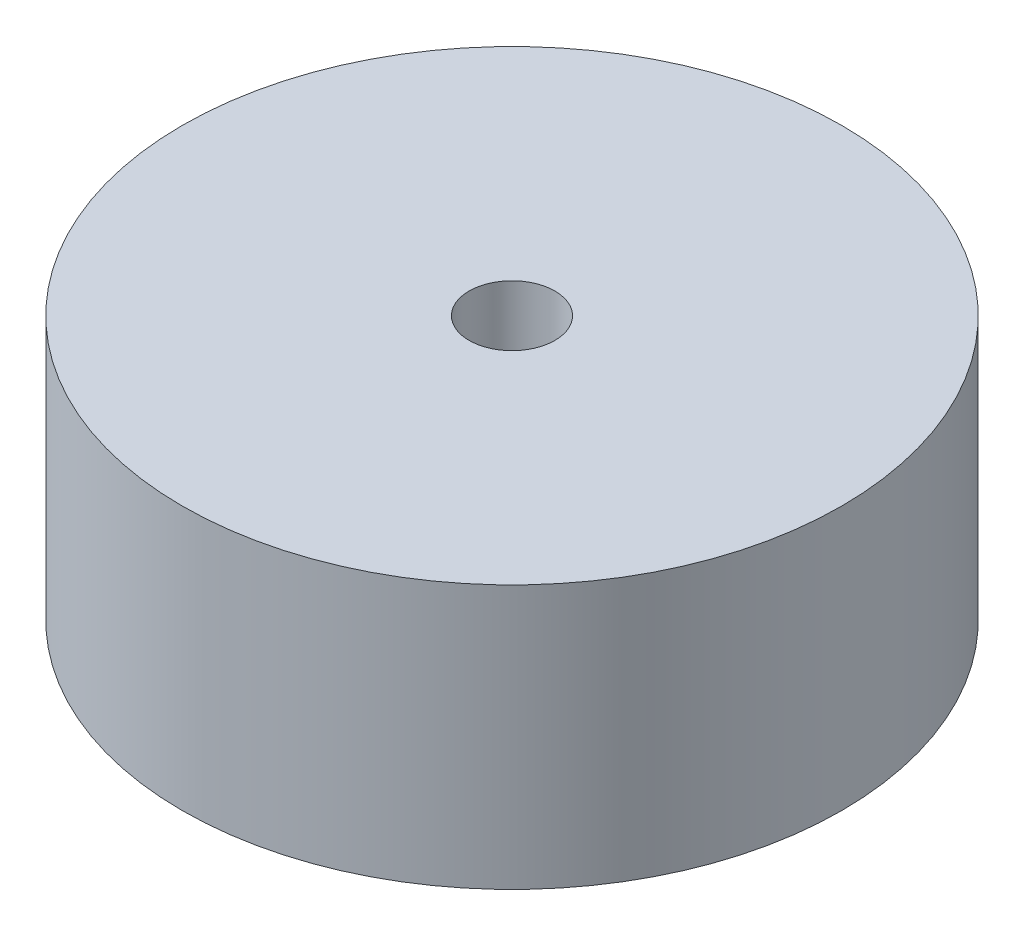
ISO-10303-21;
HEADER;
FILE_DESCRIPTION(('STEP AP214'),'2;1');
FILE_NAME('part.step','',(''),(''),'','','');
FILE_SCHEMA(('AUTOMOTIVE_DESIGN { 1 0 10303 214 1 1 1 1 }'));
ENDSEC;
DATA;
#1=APPLICATION_CONTEXT('core data for automotive mechanical design processes');
#2=APPLICATION_PROTOCOL_DEFINITION('international standard','automotive_design',2000,#1);
#3=PRODUCT_CONTEXT('',#1,'mechanical');
#4=PRODUCT('Part','Part','',(#3));
#5=PRODUCT_RELATED_PRODUCT_CATEGORY('part','',(#4));
#6=PRODUCT_DEFINITION_FORMATION('','',#4);
#7=PRODUCT_DEFINITION_CONTEXT('part definition',#1,'design');
#8=PRODUCT_DEFINITION('design','',#6,#7);
#9=PRODUCT_DEFINITION_SHAPE('','',#8);
#10=(LENGTH_UNIT() NAMED_UNIT(*) SI_UNIT(.MILLI.,.METRE.));
#11=(NAMED_UNIT(*) PLANE_ANGLE_UNIT() SI_UNIT($,.RADIAN.));
#12=(NAMED_UNIT(*) SI_UNIT($,.STERADIAN.) SOLID_ANGLE_UNIT());
#13=UNCERTAINTY_MEASURE_WITH_UNIT(LENGTH_MEASURE(1.E-05),#10,'distance_accuracy_value','');
#14=(GEOMETRIC_REPRESENTATION_CONTEXT(3) GLOBAL_UNCERTAINTY_ASSIGNED_CONTEXT((#13)) GLOBAL_UNIT_ASSIGNED_CONTEXT((#10,
#11,#12)) REPRESENTATION_CONTEXT('',''));
#15=CARTESIAN_POINT('',(0.,0.,0.));
#16=DIRECTION('',(0.,0.,1.));
#17=DIRECTION('',(1.,0.,0.));
#18=AXIS2_PLACEMENT_3D('',#15,#16,#17);
#19=CARTESIAN_POINT('',(0.,40.,0.));
#20=DIRECTION('',(0.,-1.,0.));
#21=DIRECTION('',(0.,0.,-1.));
#22=AXIS2_PLACEMENT_3D('',#19,#20,#21);
#23=CYLINDRICAL_SURFACE('',#22,50.);
#24=CARTESIAN_POINT('',(0.,40.,0.));
#25=DIRECTION('',(0.,1.,0.));
#26=DIRECTION('',(0.,0.,1.));
#27=AXIS2_PLACEMENT_3D('',#24,#25,#26);
#28=CIRCLE('',#27,50.);
#29=CARTESIAN_POINT('',(0.,40.,50.));
#30=VERTEX_POINT('',#29);
#31=EDGE_CURVE('E10',#30,#30,#28,.T.);
#32=ORIENTED_EDGE('',*,*,#31,.F.);
#33=EDGE_LOOP('',(#32));
#34=FACE_BOUND('',#33,.T.);
#35=CARTESIAN_POINT('',(0.,0.,0.));
#36=DIRECTION('',(0.,1.,0.));
#37=DIRECTION('',(0.,0.,1.));
#38=AXIS2_PLACEMENT_3D('',#35,#36,#37);
#39=CIRCLE('',#38,50.);
#40=CARTESIAN_POINT('',(0.,0.,50.));
#41=VERTEX_POINT('',#40);
#42=EDGE_CURVE('E34',#41,#41,#39,.T.);
#43=ORIENTED_EDGE('',*,*,#42,.T.);
#44=EDGE_LOOP('',(#43));
#45=FACE_BOUND('',#44,.T.);
#46=ADVANCED_FACE('F31',(#34,#45),#23,.T.);
#47=CARTESIAN_POINT('',(0.,40.,0.));
#48=DIRECTION('',(0.,1.,0.));
#49=DIRECTION('',(0.,0.,1.));
#50=AXIS2_PLACEMENT_3D('',#47,#48,#49);
#51=PLANE('',#50);
#52=CARTESIAN_POINT('',(0.,40.,0.));
#53=DIRECTION('',(0.,-1.,0.));
#54=DIRECTION('',(0.,0.,-1.));
#55=AXIS2_PLACEMENT_3D('',#52,#53,#54);
#56=CIRCLE('',#55,6.49999999999999);
#57=CARTESIAN_POINT('',(0.,40.,-6.49999999999999));
#58=VERTEX_POINT('',#57);
#59=EDGE_CURVE('E41',#58,#58,#56,.T.);
#60=ORIENTED_EDGE('',*,*,#59,.T.);
#61=EDGE_LOOP('',(#60));
#62=FACE_BOUND('',#61,.T.);
#63=ORIENTED_EDGE('',*,*,#31,.T.);
#64=EDGE_LOOP('',(#63));
#65=FACE_BOUND('',#64,.T.);
#66=ADVANCED_FACE('F54',(#62,#65),#51,.T.);
#67=CARTESIAN_POINT('',(0.,0.,0.));
#68=DIRECTION('',(0.,1.,0.));
#69=DIRECTION('',(0.,0.,1.));
#70=AXIS2_PLACEMENT_3D('',#67,#68,#69);
#71=PLANE('',#70);
#72=CARTESIAN_POINT('',(0.,0.,0.));
#73=DIRECTION('',(0.,-1.,0.));
#74=DIRECTION('',(0.,0.,-1.));
#75=AXIS2_PLACEMENT_3D('',#72,#73,#74);
#76=CIRCLE('',#75,6.5);
#77=CARTESIAN_POINT('',(0.,0.,-6.5));
#78=VERTEX_POINT('',#77);
#79=EDGE_CURVE('E45',#78,#78,#76,.T.);
#80=ORIENTED_EDGE('',*,*,#79,.F.);
#81=EDGE_LOOP('',(#80));
#82=FACE_BOUND('',#81,.T.);
#83=ORIENTED_EDGE('',*,*,#42,.F.);
#84=EDGE_LOOP('',(#83));
#85=FACE_BOUND('',#84,.T.);
#86=ADVANCED_FACE('F51',(#82,#85),#71,.F.);
#87=CARTESIAN_POINT('',(0.,0.,0.));
#88=DIRECTION('',(0.,-1.,0.));
#89=DIRECTION('',(0.,0.,-1.));
#90=AXIS2_PLACEMENT_3D('',#87,#88,#89);
#91=CYLINDRICAL_SURFACE('',#90,6.49999999999999);
#92=ORIENTED_EDGE('',*,*,#59,.F.);
#93=EDGE_LOOP('',(#92));
#94=FACE_BOUND('',#93,.T.);
#95=ORIENTED_EDGE('',*,*,#79,.T.);
#96=EDGE_LOOP('',(#95));
#97=FACE_BOUND('',#96,.T.);
#98=ADVANCED_FACE('F49',(#94,#97),#91,.F.);
#99=CLOSED_SHELL('',(#46,#66,#86,#98));
#100=MANIFOLD_SOLID_BREP('B2',#99);
#101=ADVANCED_BREP_SHAPE_REPRESENTATION('',(#18,#100),#14);
#102=SHAPE_DEFINITION_REPRESENTATION(#9,#101);
ENDSEC;
END-ISO-10303-21;
